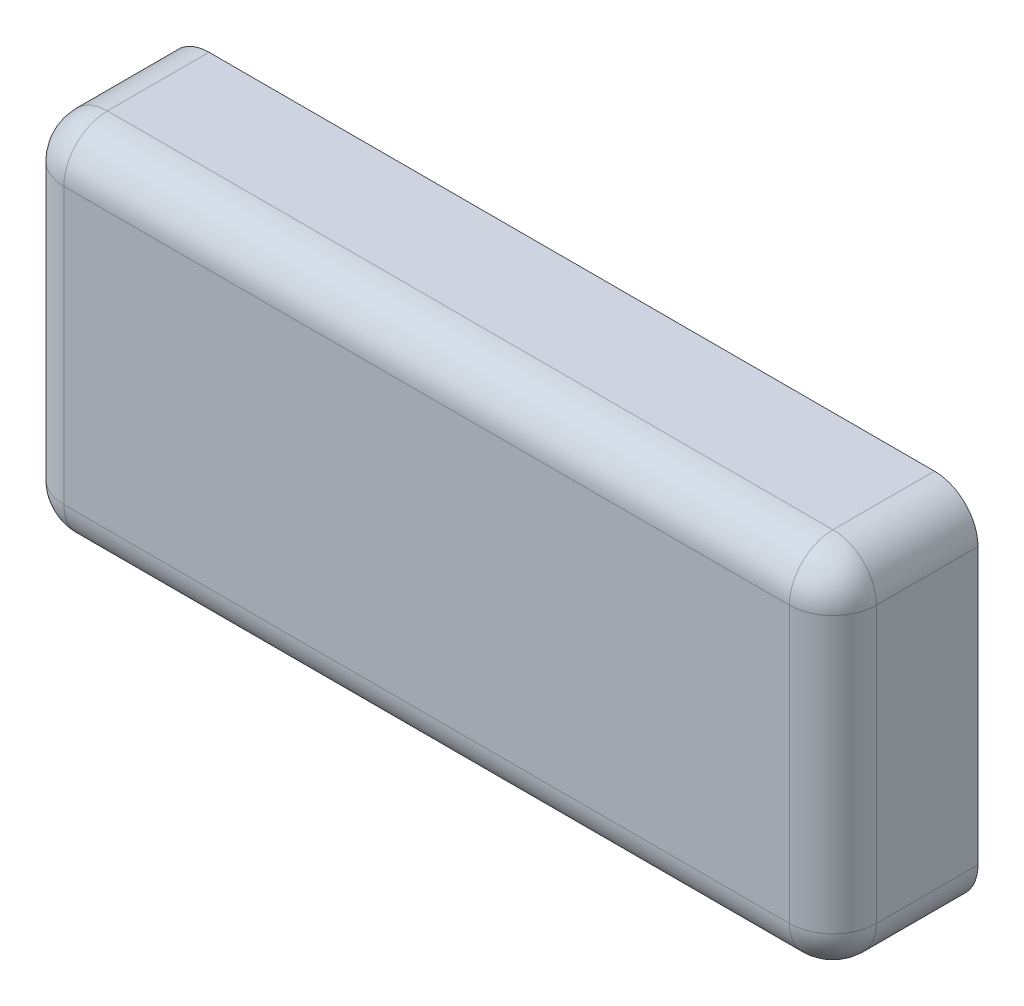
ISO-10303-21;
HEADER;
FILE_DESCRIPTION(('STEP AP214'),'2;1');
FILE_NAME('part.step','',(''),(''),'','','');
FILE_SCHEMA(('AUTOMOTIVE_DESIGN { 1 0 10303 214 1 1 1 1 }'));
ENDSEC;
DATA;
#1=APPLICATION_CONTEXT('core data for automotive mechanical design processes');
#2=APPLICATION_PROTOCOL_DEFINITION('international standard','automotive_design',2000,#1);
#3=PRODUCT_CONTEXT('',#1,'mechanical');
#4=PRODUCT('Part','Part','',(#3));
#5=PRODUCT_RELATED_PRODUCT_CATEGORY('part','',(#4));
#6=PRODUCT_DEFINITION_FORMATION('','',#4);
#7=PRODUCT_DEFINITION_CONTEXT('part definition',#1,'design');
#8=PRODUCT_DEFINITION('design','',#6,#7);
#9=PRODUCT_DEFINITION_SHAPE('','',#8);
#10=(LENGTH_UNIT() NAMED_UNIT(*) SI_UNIT(.MILLI.,.METRE.));
#11=(NAMED_UNIT(*) PLANE_ANGLE_UNIT() SI_UNIT($,.RADIAN.));
#12=(NAMED_UNIT(*) SI_UNIT($,.STERADIAN.) SOLID_ANGLE_UNIT());
#13=UNCERTAINTY_MEASURE_WITH_UNIT(LENGTH_MEASURE(1.E-05),#10,'distance_accuracy_value','');
#14=(GEOMETRIC_REPRESENTATION_CONTEXT(3) GLOBAL_UNCERTAINTY_ASSIGNED_CONTEXT((#13)) GLOBAL_UNIT_ASSIGNED_CONTEXT((#10,
#11,#12)) REPRESENTATION_CONTEXT('',''));
#15=CARTESIAN_POINT('',(0.,0.,0.));
#16=DIRECTION('',(0.,0.,1.));
#17=DIRECTION('',(1.,0.,0.));
#18=AXIS2_PLACEMENT_3D('',#15,#16,#17);
#19=CARTESIAN_POINT('',(7.112,-3.175,2.54));
#20=DIRECTION('',(-1.,0.,0.));
#21=DIRECTION('',(0.,0.,1.));
#22=AXIS2_PLACEMENT_3D('',#19,#20,#21);
#23=PLANE('',#22);
#24=DIRECTION('',(0.,0.,-1.));
#25=VECTOR('',#24,1.);
#26=CARTESIAN_POINT('',(7.112,2.413,2.54));
#27=LINE('',#26,#25);
#28=CARTESIAN_POINT('',(7.112,2.413,0.));
#29=VERTEX_POINT('',#28);
#30=CARTESIAN_POINT('',(7.112,2.413,1.778));
#31=VERTEX_POINT('',#30);
#32=EDGE_CURVE('E151',#29,#31,#27,.F.);
#33=ORIENTED_EDGE('',*,*,#32,.T.);
#34=DIRECTION('',(0.,1.,0.));
#35=VECTOR('',#34,1.);
#36=CARTESIAN_POINT('',(7.112,-3.175,1.778));
#37=LINE('',#36,#35);
#38=CARTESIAN_POINT('',(7.112,-2.413,1.778));
#39=VERTEX_POINT('',#38);
#40=EDGE_CURVE('E170',#31,#39,#37,.F.);
#41=ORIENTED_EDGE('',*,*,#40,.T.);
#42=DIRECTION('',(0.,0.,-1.));
#43=VECTOR('',#42,1.);
#44=CARTESIAN_POINT('',(7.112,-2.413,2.54));
#45=LINE('',#44,#43);
#46=CARTESIAN_POINT('',(7.112,-2.413,0.));
#47=VERTEX_POINT('',#46);
#48=EDGE_CURVE('E149',#39,#47,#45,.T.);
#49=ORIENTED_EDGE('',*,*,#48,.T.);
#50=DIRECTION('',(0.,1.,0.));
#51=VECTOR('',#50,1.);
#52=CARTESIAN_POINT('',(7.112,-3.175,0.));
#53=LINE('',#52,#51);
#54=EDGE_CURVE('E198',#47,#29,#53,.T.);
#55=ORIENTED_EDGE('',*,*,#54,.T.);
#56=EDGE_LOOP('',(#33,#41,#49,#55));
#57=FACE_BOUND('',#56,.T.);
#58=ADVANCED_FACE('F32',(#57),#23,.F.);
#59=CARTESIAN_POINT('',(-7.112,3.175,2.54));
#60=DIRECTION('',(0.,-1.,0.));
#61=DIRECTION('',(0.,0.,-1.));
#62=AXIS2_PLACEMENT_3D('',#59,#60,#61);
#63=PLANE('',#62);
#64=DIRECTION('',(0.,0.,-1.));
#65=VECTOR('',#64,1.);
#66=CARTESIAN_POINT('',(-6.35,3.175,2.54));
#67=LINE('',#66,#65);
#68=CARTESIAN_POINT('',(-6.35,3.175,0.));
#69=VERTEX_POINT('',#68);
#70=CARTESIAN_POINT('',(-6.35,3.175,1.778));
#71=VERTEX_POINT('',#70);
#72=EDGE_CURVE('E146',#69,#71,#67,.F.);
#73=ORIENTED_EDGE('',*,*,#72,.T.);
#74=DIRECTION('',(-1.,0.,0.));
#75=VECTOR('',#74,1.);
#76=CARTESIAN_POINT('',(-7.112,3.175,1.778));
#77=LINE('',#76,#75);
#78=CARTESIAN_POINT('',(6.35,3.175,1.778));
#79=VERTEX_POINT('',#78);
#80=EDGE_CURVE('E166',#71,#79,#77,.F.);
#81=ORIENTED_EDGE('',*,*,#80,.T.);
#82=DIRECTION('',(0.,0.,-1.));
#83=VECTOR('',#82,1.);
#84=CARTESIAN_POINT('',(6.35,3.175,2.54));
#85=LINE('',#84,#83);
#86=CARTESIAN_POINT('',(6.35,3.175,0.));
#87=VERTEX_POINT('',#86);
#88=EDGE_CURVE('E144',#79,#87,#85,.T.);
#89=ORIENTED_EDGE('',*,*,#88,.T.);
#90=DIRECTION('',(-1.,0.,0.));
#91=VECTOR('',#90,1.);
#92=CARTESIAN_POINT('',(-7.112,3.175,0.));
#93=LINE('',#92,#91);
#94=EDGE_CURVE('E134',#87,#69,#93,.T.);
#95=ORIENTED_EDGE('',*,*,#94,.T.);
#96=EDGE_LOOP('',(#73,#81,#89,#95));
#97=FACE_BOUND('',#96,.T.);
#98=ADVANCED_FACE('F210',(#97),#63,.F.);
#99=CARTESIAN_POINT('',(-7.112,-3.175,2.54));
#100=DIRECTION('',(1.,0.,0.));
#101=DIRECTION('',(0.,0.,-1.));
#102=AXIS2_PLACEMENT_3D('',#99,#100,#101);
#103=PLANE('',#102);
#104=DIRECTION('',(0.,0.,-1.));
#105=VECTOR('',#104,1.);
#106=CARTESIAN_POINT('',(-7.112,-2.413,2.54));
#107=LINE('',#106,#105);
#108=CARTESIAN_POINT('',(-7.112,-2.413,0.));
#109=VERTEX_POINT('',#108);
#110=CARTESIAN_POINT('',(-7.112,-2.413,1.778));
#111=VERTEX_POINT('',#110);
#112=EDGE_CURVE('E121',#109,#111,#107,.F.);
#113=ORIENTED_EDGE('',*,*,#112,.T.);
#114=DIRECTION('',(0.,-1.,0.));
#115=VECTOR('',#114,1.);
#116=CARTESIAN_POINT('',(-7.112,-3.175,1.778));
#117=LINE('',#116,#115);
#118=CARTESIAN_POINT('',(-7.112,2.413,1.778));
#119=VERTEX_POINT('',#118);
#120=EDGE_CURVE('E11',#111,#119,#117,.F.);
#121=ORIENTED_EDGE('',*,*,#120,.T.);
#122=DIRECTION('',(0.,0.,-1.));
#123=VECTOR('',#122,1.);
#124=CARTESIAN_POINT('',(-7.112,2.413,2.54));
#125=LINE('',#124,#123);
#126=CARTESIAN_POINT('',(-7.112,2.413,0.));
#127=VERTEX_POINT('',#126);
#128=EDGE_CURVE('E125',#119,#127,#125,.T.);
#129=ORIENTED_EDGE('',*,*,#128,.T.);
#130=DIRECTION('',(0.,-1.,0.));
#131=VECTOR('',#130,1.);
#132=CARTESIAN_POINT('',(-7.112,-3.175,0.));
#133=LINE('',#132,#131);
#134=EDGE_CURVE('E131',#127,#109,#133,.T.);
#135=ORIENTED_EDGE('',*,*,#134,.T.);
#136=EDGE_LOOP('',(#113,#121,#129,#135));
#137=FACE_BOUND('',#136,.T.);
#138=ADVANCED_FACE('F262',(#137),#103,.F.);
#139=CARTESIAN_POINT('',(-7.112,-3.175,2.54));
#140=DIRECTION('',(0.,1.,0.));
#141=DIRECTION('',(0.,0.,1.));
#142=AXIS2_PLACEMENT_3D('',#139,#140,#141);
#143=PLANE('',#142);
#144=DIRECTION('',(0.,0.,-1.));
#145=VECTOR('',#144,1.);
#146=CARTESIAN_POINT('',(6.35,-3.175,2.54));
#147=LINE('',#146,#145);
#148=CARTESIAN_POINT('',(6.35,-3.175,0.));
#149=VERTEX_POINT('',#148);
#150=CARTESIAN_POINT('',(6.35,-3.175,1.778));
#151=VERTEX_POINT('',#150);
#152=EDGE_CURVE('E117',#149,#151,#147,.F.);
#153=ORIENTED_EDGE('',*,*,#152,.T.);
#154=DIRECTION('',(1.,0.,0.));
#155=VECTOR('',#154,1.);
#156=CARTESIAN_POINT('',(-7.112,-3.175,1.778));
#157=LINE('',#156,#155);
#158=CARTESIAN_POINT('',(-6.35,-3.175,1.778));
#159=VERTEX_POINT('',#158);
#160=EDGE_CURVE('E56',#151,#159,#157,.F.);
#161=ORIENTED_EDGE('',*,*,#160,.T.);
#162=DIRECTION('',(0.,0.,-1.));
#163=VECTOR('',#162,1.);
#164=CARTESIAN_POINT('',(-6.35,-3.175,2.54));
#165=LINE('',#164,#163);
#166=CARTESIAN_POINT('',(-6.35,-3.175,0.));
#167=VERTEX_POINT('',#166);
#168=EDGE_CURVE('E109',#159,#167,#165,.T.);
#169=ORIENTED_EDGE('',*,*,#168,.T.);
#170=DIRECTION('',(1.,0.,0.));
#171=VECTOR('',#170,1.);
#172=CARTESIAN_POINT('',(-7.112,-3.175,0.));
#173=LINE('',#172,#171);
#174=EDGE_CURVE('E113',#167,#149,#173,.T.);
#175=ORIENTED_EDGE('',*,*,#174,.T.);
#176=EDGE_LOOP('',(#153,#161,#169,#175));
#177=FACE_BOUND('',#176,.T.);
#178=ADVANCED_FACE('F111',(#177),#143,.F.);
#179=CARTESIAN_POINT('',(7.112,3.175,2.54));
#180=DIRECTION('',(0.,0.,-1.));
#181=DIRECTION('',(-1.,0.,0.));
#182=AXIS2_PLACEMENT_3D('',#179,#180,#181);
#183=PLANE('',#182);
#184=DIRECTION('',(0.,1.,0.));
#185=VECTOR('',#184,1.);
#186=CARTESIAN_POINT('',(6.35,3.175,2.54));
#187=LINE('',#186,#185);
#188=CARTESIAN_POINT('',(6.35,-2.413,2.54));
#189=VERTEX_POINT('',#188);
#190=CARTESIAN_POINT('',(6.35,2.413,2.54));
#191=VERTEX_POINT('',#190);
#192=EDGE_CURVE('E161',#189,#191,#187,.T.);
#193=ORIENTED_EDGE('',*,*,#192,.T.);
#194=DIRECTION('',(-1.,0.,0.));
#195=VECTOR('',#194,1.);
#196=CARTESIAN_POINT('',(7.112,2.413,2.54));
#197=LINE('',#196,#195);
#198=CARTESIAN_POINT('',(-6.35,2.413,2.54));
#199=VERTEX_POINT('',#198);
#200=EDGE_CURVE('E163',#191,#199,#197,.T.);
#201=ORIENTED_EDGE('',*,*,#200,.T.);
#202=DIRECTION('',(0.,-1.,0.));
#203=VECTOR('',#202,1.);
#204=CARTESIAN_POINT('',(-6.35,3.175,2.54));
#205=LINE('',#204,#203);
#206=CARTESIAN_POINT('',(-6.35,-2.413,2.54));
#207=VERTEX_POINT('',#206);
#208=EDGE_CURVE('E157',#199,#207,#205,.T.);
#209=ORIENTED_EDGE('',*,*,#208,.T.);
#210=DIRECTION('',(1.,0.,0.));
#211=VECTOR('',#210,1.);
#212=CARTESIAN_POINT('',(7.112,-2.413,2.54));
#213=LINE('',#212,#211);
#214=EDGE_CURVE('E159',#207,#189,#213,.T.);
#215=ORIENTED_EDGE('',*,*,#214,.T.);
#216=EDGE_LOOP('',(#193,#201,#209,#215));
#217=FACE_BOUND('',#216,.T.);
#218=ADVANCED_FACE('F230',(#217),#183,.F.);
#219=CARTESIAN_POINT('',(7.112,3.175,0.));
#220=DIRECTION('',(0.,0.,-1.));
#221=DIRECTION('',(-1.,0.,0.));
#222=AXIS2_PLACEMENT_3D('',#219,#220,#221);
#223=PLANE('',#222);
#224=ORIENTED_EDGE('',*,*,#174,.F.);
#225=CARTESIAN_POINT('',(-6.35,-2.413,0.));
#226=DIRECTION('',(0.,0.,-1.));
#227=DIRECTION('',(-1.,0.,0.));
#228=AXIS2_PLACEMENT_3D('',#225,#226,#227);
#229=CIRCLE('',#228,0.762);
#230=EDGE_CURVE('E119',#167,#109,#229,.T.);
#231=ORIENTED_EDGE('',*,*,#230,.T.);
#232=ORIENTED_EDGE('',*,*,#134,.F.);
#233=CARTESIAN_POINT('',(-6.35,2.413,0.));
#234=DIRECTION('',(0.,0.,-1.));
#235=DIRECTION('',(-1.,0.,0.));
#236=AXIS2_PLACEMENT_3D('',#233,#234,#235);
#237=CIRCLE('',#236,0.762);
#238=EDGE_CURVE('E126',#127,#69,#237,.T.);
#239=ORIENTED_EDGE('',*,*,#238,.T.);
#240=ORIENTED_EDGE('',*,*,#94,.F.);
#241=CARTESIAN_POINT('',(6.35,2.413,0.));
#242=DIRECTION('',(0.,0.,-1.));
#243=DIRECTION('',(-1.,0.,0.));
#244=AXIS2_PLACEMENT_3D('',#241,#242,#243);
#245=CIRCLE('',#244,0.762);
#246=EDGE_CURVE('E139',#87,#29,#245,.T.);
#247=ORIENTED_EDGE('',*,*,#246,.T.);
#248=ORIENTED_EDGE('',*,*,#54,.F.);
#249=CARTESIAN_POINT('',(6.35,-2.413,0.));
#250=DIRECTION('',(0.,0.,-1.));
#251=DIRECTION('',(-1.,0.,0.));
#252=AXIS2_PLACEMENT_3D('',#249,#250,#251);
#253=CIRCLE('',#252,0.762);
#254=EDGE_CURVE('E116',#47,#149,#253,.T.);
#255=ORIENTED_EDGE('',*,*,#254,.T.);
#256=EDGE_LOOP('',(#224,#231,#232,#239,#240,#247,#248,#255));
#257=FACE_BOUND('',#256,.T.);
#258=ADVANCED_FACE('F128',(#257),#223,.T.);
#259=CARTESIAN_POINT('',(-6.35,-2.413,2.54));
#260=DIRECTION('',(0.,0.,-1.));
#261=DIRECTION('',(-1.,0.,0.));
#262=AXIS2_PLACEMENT_3D('',#259,#260,#261);
#263=CYLINDRICAL_SURFACE('',#262,0.762);
#264=ORIENTED_EDGE('',*,*,#168,.F.);
#265=CARTESIAN_POINT('',(-6.35,-2.413,1.778));
#266=DIRECTION('',(0.,0.,-1.));
#267=DIRECTION('',(-1.,0.,0.));
#268=AXIS2_PLACEMENT_3D('',#265,#266,#267);
#269=CIRCLE('',#268,0.762);
#270=EDGE_CURVE('E41',#159,#111,#269,.T.);
#271=ORIENTED_EDGE('',*,*,#270,.T.);
#272=ORIENTED_EDGE('',*,*,#112,.F.);
#273=ORIENTED_EDGE('',*,*,#230,.F.);
#274=EDGE_LOOP('',(#264,#271,#272,#273));
#275=FACE_BOUND('',#274,.T.);
#276=ADVANCED_FACE('F120',(#275),#263,.T.);
#277=CARTESIAN_POINT('',(-6.35,2.413,2.54));
#278=DIRECTION('',(0.,0.,-1.));
#279=DIRECTION('',(-1.,0.,0.));
#280=AXIS2_PLACEMENT_3D('',#277,#278,#279);
#281=CYLINDRICAL_SURFACE('',#280,0.762);
#282=ORIENTED_EDGE('',*,*,#128,.F.);
#283=CARTESIAN_POINT('',(-6.35,2.413,1.778));
#284=DIRECTION('',(0.,0.,-1.));
#285=DIRECTION('',(-1.,0.,0.));
#286=AXIS2_PLACEMENT_3D('',#283,#284,#285);
#287=CIRCLE('',#286,0.762);
#288=EDGE_CURVE('E154',#119,#71,#287,.T.);
#289=ORIENTED_EDGE('',*,*,#288,.T.);
#290=ORIENTED_EDGE('',*,*,#72,.F.);
#291=ORIENTED_EDGE('',*,*,#238,.F.);
#292=EDGE_LOOP('',(#282,#289,#290,#291));
#293=FACE_BOUND('',#292,.T.);
#294=ADVANCED_FACE('F216',(#293),#281,.T.);
#295=CARTESIAN_POINT('',(6.35,2.413,2.54));
#296=DIRECTION('',(0.,0.,-1.));
#297=DIRECTION('',(-1.,0.,0.));
#298=AXIS2_PLACEMENT_3D('',#295,#296,#297);
#299=CYLINDRICAL_SURFACE('',#298,0.762);
#300=ORIENTED_EDGE('',*,*,#88,.F.);
#301=CARTESIAN_POINT('',(6.35,2.413,1.778));
#302=DIRECTION('',(0.,0.,-1.));
#303=DIRECTION('',(-1.,0.,0.));
#304=AXIS2_PLACEMENT_3D('',#301,#302,#303);
#305=CIRCLE('',#304,0.762);
#306=EDGE_CURVE('E168',#79,#31,#305,.T.);
#307=ORIENTED_EDGE('',*,*,#306,.T.);
#308=ORIENTED_EDGE('',*,*,#32,.F.);
#309=ORIENTED_EDGE('',*,*,#246,.F.);
#310=EDGE_LOOP('',(#300,#307,#308,#309));
#311=FACE_BOUND('',#310,.T.);
#312=ADVANCED_FACE('F237',(#311),#299,.T.);
#313=CARTESIAN_POINT('',(6.35,-2.413,2.54));
#314=DIRECTION('',(0.,0.,-1.));
#315=DIRECTION('',(-1.,0.,0.));
#316=AXIS2_PLACEMENT_3D('',#313,#314,#315);
#317=CYLINDRICAL_SURFACE('',#316,0.762);
#318=ORIENTED_EDGE('',*,*,#48,.F.);
#319=CARTESIAN_POINT('',(6.35,-2.413,1.778));
#320=DIRECTION('',(0.,0.,-1.));
#321=DIRECTION('',(-1.,0.,0.));
#322=AXIS2_PLACEMENT_3D('',#319,#320,#321);
#323=CIRCLE('',#322,0.762);
#324=EDGE_CURVE('E172',#39,#151,#323,.T.);
#325=ORIENTED_EDGE('',*,*,#324,.T.);
#326=ORIENTED_EDGE('',*,*,#152,.F.);
#327=ORIENTED_EDGE('',*,*,#254,.F.);
#328=EDGE_LOOP('',(#318,#325,#326,#327));
#329=FACE_BOUND('',#328,.T.);
#330=ADVANCED_FACE('F244',(#329),#317,.T.);
#331=CARTESIAN_POINT('',(6.35,-2.413,1.778));
#332=DIRECTION('',(0.,0.,1.));
#333=DIRECTION('',(1.,0.,0.));
#334=AXIS2_PLACEMENT_3D('',#331,#332,#333);
#335=SPHERICAL_SURFACE('',#334,0.762);
#336=CARTESIAN_POINT('',(6.35,-2.413,1.778));
#337=DIRECTION('',(-1.,0.,0.));
#338=DIRECTION('',(0.,-1.,0.));
#339=AXIS2_PLACEMENT_3D('',#336,#337,#338);
#340=CIRCLE('',#339,0.762);
#341=EDGE_CURVE('E191',#151,#189,#340,.T.);
#342=ORIENTED_EDGE('',*,*,#341,.F.);
#343=ORIENTED_EDGE('',*,*,#324,.F.);
#344=CARTESIAN_POINT('',(6.35,-2.413,1.778));
#345=DIRECTION('',(0.,1.,0.));
#346=DIRECTION('',(0.,0.,1.));
#347=AXIS2_PLACEMENT_3D('',#344,#345,#346);
#348=CIRCLE('',#347,0.762);
#349=EDGE_CURVE('E36',#189,#39,#348,.T.);
#350=ORIENTED_EDGE('',*,*,#349,.F.);
#351=EDGE_LOOP('',(#342,#343,#350));
#352=FACE_BOUND('',#351,.T.);
#353=ADVANCED_FACE('F34',(#352),#335,.T.);
#354=CARTESIAN_POINT('',(6.35,3.175,1.778));
#355=DIRECTION('',(0.,1.,0.));
#356=DIRECTION('',(0.,0.,1.));
#357=AXIS2_PLACEMENT_3D('',#354,#355,#356);
#358=CYLINDRICAL_SURFACE('',#357,0.762);
#359=ORIENTED_EDGE('',*,*,#349,.T.);
#360=ORIENTED_EDGE('',*,*,#40,.F.);
#361=CARTESIAN_POINT('',(6.35,2.413,1.778));
#362=DIRECTION('',(0.,1.,0.));
#363=DIRECTION('',(-1.,0.,0.));
#364=AXIS2_PLACEMENT_3D('',#361,#362,#363);
#365=CIRCLE('',#364,0.762);
#366=EDGE_CURVE('E189',#191,#31,#365,.T.);
#367=ORIENTED_EDGE('',*,*,#366,.F.);
#368=ORIENTED_EDGE('',*,*,#192,.F.);
#369=EDGE_LOOP('',(#359,#360,#367,#368));
#370=FACE_BOUND('',#369,.T.);
#371=ADVANCED_FACE('F240',(#370),#358,.T.);
#372=CARTESIAN_POINT('',(7.112,-2.413,1.778));
#373=DIRECTION('',(1.,0.,0.));
#374=DIRECTION('',(0.,0.,-1.));
#375=AXIS2_PLACEMENT_3D('',#372,#373,#374);
#376=CYLINDRICAL_SURFACE('',#375,0.762);
#377=ORIENTED_EDGE('',*,*,#341,.T.);
#378=ORIENTED_EDGE('',*,*,#214,.F.);
#379=CARTESIAN_POINT('',(-6.35,-2.413,1.778));
#380=DIRECTION('',(-1.,0.,0.));
#381=DIRECTION('',(0.,0.,1.));
#382=AXIS2_PLACEMENT_3D('',#379,#380,#381);
#383=CIRCLE('',#382,0.762);
#384=EDGE_CURVE('E186',#159,#207,#383,.T.);
#385=ORIENTED_EDGE('',*,*,#384,.F.);
#386=ORIENTED_EDGE('',*,*,#160,.F.);
#387=EDGE_LOOP('',(#377,#378,#385,#386));
#388=FACE_BOUND('',#387,.T.);
#389=ADVANCED_FACE('F246',(#388),#376,.T.);
#390=CARTESIAN_POINT('',(6.35,2.413,1.778));
#391=DIRECTION('',(0.,0.,1.));
#392=DIRECTION('',(1.,0.,0.));
#393=AXIS2_PLACEMENT_3D('',#390,#391,#392);
#394=SPHERICAL_SURFACE('',#393,0.762);
#395=ORIENTED_EDGE('',*,*,#366,.T.);
#396=ORIENTED_EDGE('',*,*,#306,.F.);
#397=CARTESIAN_POINT('',(6.35,2.413,1.778));
#398=DIRECTION('',(-1.,0.,0.));
#399=DIRECTION('',(0.,0.,1.));
#400=AXIS2_PLACEMENT_3D('',#397,#398,#399);
#401=CIRCLE('',#400,0.762);
#402=EDGE_CURVE('E183',#191,#79,#401,.T.);
#403=ORIENTED_EDGE('',*,*,#402,.F.);
#404=EDGE_LOOP('',(#395,#396,#403));
#405=FACE_BOUND('',#404,.T.);
#406=ADVANCED_FACE('F239',(#405),#394,.T.);
#407=CARTESIAN_POINT('',(-6.35,-2.413,1.778));
#408=DIRECTION('',(0.,0.,1.));
#409=DIRECTION('',(1.,0.,0.));
#410=AXIS2_PLACEMENT_3D('',#407,#408,#409);
#411=SPHERICAL_SURFACE('',#410,0.762);
#412=ORIENTED_EDGE('',*,*,#270,.F.);
#413=ORIENTED_EDGE('',*,*,#384,.T.);
#414=CARTESIAN_POINT('',(-6.35,-2.413,1.778));
#415=DIRECTION('',(0.,1.,0.));
#416=DIRECTION('',(0.,0.,1.));
#417=AXIS2_PLACEMENT_3D('',#414,#415,#416);
#418=CIRCLE('',#417,0.762);
#419=EDGE_CURVE('E180',#111,#207,#418,.T.);
#420=ORIENTED_EDGE('',*,*,#419,.F.);
#421=EDGE_LOOP('',(#412,#413,#420));
#422=FACE_BOUND('',#421,.T.);
#423=ADVANCED_FACE('F248',(#422),#411,.T.);
#424=CARTESIAN_POINT('',(7.112,2.413,1.778));
#425=DIRECTION('',(-1.,0.,0.));
#426=DIRECTION('',(0.,0.,1.));
#427=AXIS2_PLACEMENT_3D('',#424,#425,#426);
#428=CYLINDRICAL_SURFACE('',#427,0.762);
#429=ORIENTED_EDGE('',*,*,#402,.T.);
#430=ORIENTED_EDGE('',*,*,#80,.F.);
#431=CARTESIAN_POINT('',(-6.35,2.413,1.778));
#432=DIRECTION('',(-1.,0.,0.));
#433=DIRECTION('',(0.,0.,1.));
#434=AXIS2_PLACEMENT_3D('',#431,#432,#433);
#435=CIRCLE('',#434,0.762);
#436=EDGE_CURVE('E178',#199,#71,#435,.T.);
#437=ORIENTED_EDGE('',*,*,#436,.F.);
#438=ORIENTED_EDGE('',*,*,#200,.F.);
#439=EDGE_LOOP('',(#429,#430,#437,#438));
#440=FACE_BOUND('',#439,.T.);
#441=ADVANCED_FACE('F233',(#440),#428,.T.);
#442=CARTESIAN_POINT('',(-6.35,3.175,1.778));
#443=DIRECTION('',(0.,-1.,0.));
#444=DIRECTION('',(0.,0.,-1.));
#445=AXIS2_PLACEMENT_3D('',#442,#443,#444);
#446=CYLINDRICAL_SURFACE('',#445,0.762);
#447=ORIENTED_EDGE('',*,*,#419,.T.);
#448=ORIENTED_EDGE('',*,*,#208,.F.);
#449=CARTESIAN_POINT('',(-6.35,2.413,1.778));
#450=DIRECTION('',(0.,1.,0.));
#451=DIRECTION('',(0.,0.,1.));
#452=AXIS2_PLACEMENT_3D('',#449,#450,#451);
#453=CIRCLE('',#452,0.762);
#454=EDGE_CURVE('E176',#119,#199,#453,.T.);
#455=ORIENTED_EDGE('',*,*,#454,.F.);
#456=ORIENTED_EDGE('',*,*,#120,.F.);
#457=EDGE_LOOP('',(#447,#448,#455,#456));
#458=FACE_BOUND('',#457,.T.);
#459=ADVANCED_FACE('F226',(#458),#446,.T.);
#460=CARTESIAN_POINT('',(-6.35,2.413,1.778));
#461=DIRECTION('',(0.,0.,1.));
#462=DIRECTION('',(1.,0.,0.));
#463=AXIS2_PLACEMENT_3D('',#460,#461,#462);
#464=SPHERICAL_SURFACE('',#463,0.762);
#465=ORIENTED_EDGE('',*,*,#436,.T.);
#466=ORIENTED_EDGE('',*,*,#288,.F.);
#467=ORIENTED_EDGE('',*,*,#454,.T.);
#468=EDGE_LOOP('',(#465,#466,#467));
#469=FACE_BOUND('',#468,.T.);
#470=ADVANCED_FACE('F220',(#469),#464,.T.);
#471=CLOSED_SHELL('',(#58,#98,#138,#178,#218,#258,#276,#294,#312,#330,#353,#371,#389,#406,#423,
#441,#459,#470));
#472=MANIFOLD_SOLID_BREP('B2',#471);
#473=ADVANCED_BREP_SHAPE_REPRESENTATION('',(#18,#472),#14);
#474=SHAPE_DEFINITION_REPRESENTATION(#9,#473);
ENDSEC;
END-ISO-10303-21;
